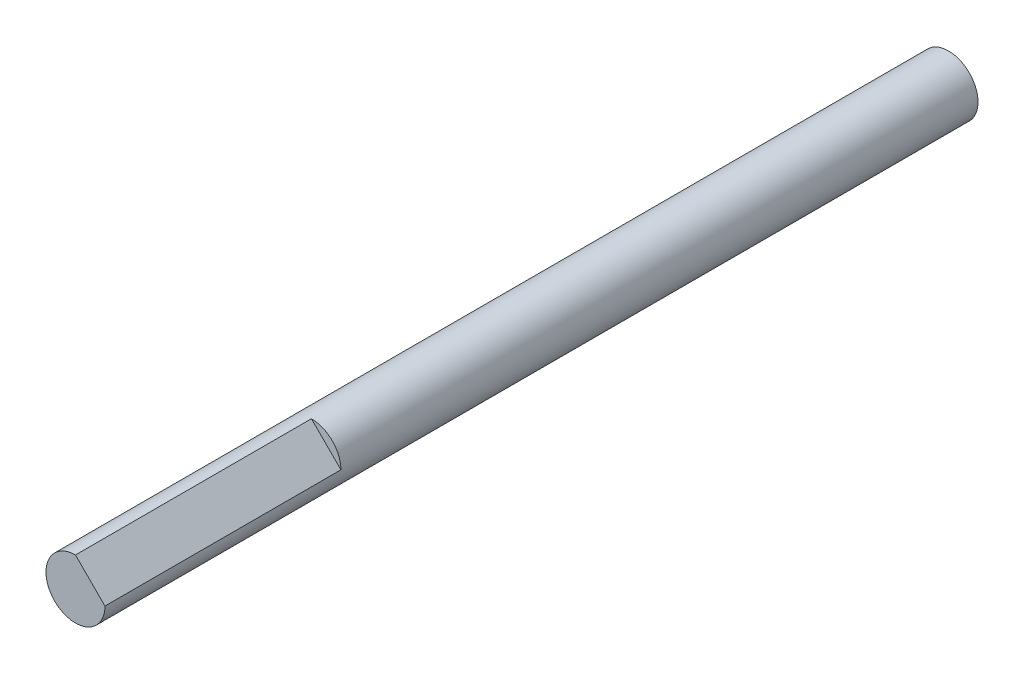
ISO-10303-21;
HEADER;
FILE_DESCRIPTION(('STEP AP214'),'2;1');
FILE_NAME('part.step','',(''),(''),'','','');
FILE_SCHEMA(('AUTOMOTIVE_DESIGN { 1 0 10303 214 1 1 1 1 }'));
ENDSEC;
DATA;
#1=APPLICATION_CONTEXT('core data for automotive mechanical design processes');
#2=APPLICATION_PROTOCOL_DEFINITION('international standard','automotive_design',2000,#1);
#3=PRODUCT_CONTEXT('',#1,'mechanical');
#4=PRODUCT('Part','Part','',(#3));
#5=PRODUCT_RELATED_PRODUCT_CATEGORY('part','',(#4));
#6=PRODUCT_DEFINITION_FORMATION('','',#4);
#7=PRODUCT_DEFINITION_CONTEXT('part definition',#1,'design');
#8=PRODUCT_DEFINITION('design','',#6,#7);
#9=PRODUCT_DEFINITION_SHAPE('','',#8);
#10=(LENGTH_UNIT() NAMED_UNIT(*) SI_UNIT(.MILLI.,.METRE.));
#11=(NAMED_UNIT(*) PLANE_ANGLE_UNIT() SI_UNIT($,.RADIAN.));
#12=(NAMED_UNIT(*) SI_UNIT($,.STERADIAN.) SOLID_ANGLE_UNIT());
#13=UNCERTAINTY_MEASURE_WITH_UNIT(LENGTH_MEASURE(1.E-05),#10,'distance_accuracy_value','');
#14=(GEOMETRIC_REPRESENTATION_CONTEXT(3) GLOBAL_UNCERTAINTY_ASSIGNED_CONTEXT((#13)) GLOBAL_UNIT_ASSIGNED_CONTEXT((#10,
#11,#12)) REPRESENTATION_CONTEXT('',''));
#15=CARTESIAN_POINT('',(0.,0.,0.));
#16=DIRECTION('',(0.,0.,1.));
#17=DIRECTION('',(1.,0.,0.));
#18=AXIS2_PLACEMENT_3D('',#15,#16,#17);
#19=CARTESIAN_POINT('',(0.,0.,0.));
#20=DIRECTION('',(0.,0.,1.));
#21=DIRECTION('',(1.,0.,0.));
#22=AXIS2_PLACEMENT_3D('',#19,#20,#21);
#23=PLANE('',#22);
#24=CARTESIAN_POINT('',(0.,0.,0.));
#25=DIRECTION('',(0.,0.,-1.));
#26=DIRECTION('',(-1.,0.,0.));
#27=AXIS2_PLACEMENT_3D('',#24,#25,#26);
#28=CIRCLE('',#27,2.5);
#29=CARTESIAN_POINT('',(-2.5,0.,0.));
#30=VERTEX_POINT('',#29);
#31=EDGE_CURVE('E40',#30,#30,#28,.T.);
#32=ORIENTED_EDGE('',*,*,#31,.T.);
#33=EDGE_LOOP('',(#32));
#34=FACE_BOUND('',#33,.T.);
#35=ADVANCED_FACE('F33',(#34),#23,.F.);
#36=CARTESIAN_POINT('',(0.,0.,0.));
#37=DIRECTION('',(0.,0.,1.));
#38=DIRECTION('',(1.,0.,0.));
#39=AXIS2_PLACEMENT_3D('',#36,#37,#38);
#40=CYLINDRICAL_SURFACE('',#39,2.5);
#41=DIRECTION('',(0.,0.,1.));
#42=VECTOR('',#41,1.);
#43=CARTESIAN_POINT('',(2.5,0.,54.));
#44=LINE('',#43,#42);
#45=CARTESIAN_POINT('',(2.5,0.,54.));
#46=VERTEX_POINT('',#45);
#47=CARTESIAN_POINT('',(2.5,0.,74.));
#48=VERTEX_POINT('',#47);
#49=EDGE_CURVE('E53',#46,#48,#44,.T.);
#50=ORIENTED_EDGE('',*,*,#49,.T.);
#51=CARTESIAN_POINT('',(0.,0.,74.));
#52=DIRECTION('',(0.,0.,1.));
#53=DIRECTION('',(1.,0.,0.));
#54=AXIS2_PLACEMENT_3D('',#51,#52,#53);
#55=CIRCLE('',#54,2.5);
#56=CARTESIAN_POINT('',(0.,2.5,74.));
#57=VERTEX_POINT('',#56);
#58=EDGE_CURVE('E12',#57,#48,#55,.T.);
#59=ORIENTED_EDGE('',*,*,#58,.F.);
#60=DIRECTION('',(0.,0.,1.));
#61=VECTOR('',#60,1.);
#62=CARTESIAN_POINT('',(0.,2.5,54.));
#63=LINE('',#62,#61);
#64=CARTESIAN_POINT('',(0.,2.5,54.));
#65=VERTEX_POINT('',#64);
#66=EDGE_CURVE('E47',#65,#57,#63,.T.);
#67=ORIENTED_EDGE('',*,*,#66,.F.);
#68=CARTESIAN_POINT('',(0.,0.,54.));
#69=DIRECTION('',(0.,0.,1.));
#70=DIRECTION('',(1.,0.,0.));
#71=AXIS2_PLACEMENT_3D('',#68,#69,#70);
#72=CIRCLE('',#71,2.5);
#73=EDGE_CURVE('E62',#46,#65,#72,.T.);
#74=ORIENTED_EDGE('',*,*,#73,.F.);
#75=EDGE_LOOP('',(#50,#59,#67,#74));
#76=FACE_BOUND('',#75,.T.);
#77=ORIENTED_EDGE('',*,*,#31,.F.);
#78=EDGE_LOOP('',(#77));
#79=FACE_BOUND('',#78,.T.);
#80=ADVANCED_FACE('F66',(#76,#79),#40,.T.);
#81=CARTESIAN_POINT('',(0.,0.,74.));
#82=DIRECTION('',(0.,0.,1.));
#83=DIRECTION('',(1.,0.,0.));
#84=AXIS2_PLACEMENT_3D('',#81,#82,#83);
#85=PLANE('',#84);
#86=DIRECTION('',(0.707106781186548,-0.707106781186548,0.));
#87=VECTOR('',#86,1.);
#88=CARTESIAN_POINT('',(2.5,0.,74.));
#89=LINE('',#88,#87);
#90=EDGE_CURVE('E58',#57,#48,#89,.T.);
#91=ORIENTED_EDGE('',*,*,#90,.F.);
#92=ORIENTED_EDGE('',*,*,#58,.T.);
#93=EDGE_LOOP('',(#91,#92));
#94=FACE_BOUND('',#93,.T.);
#95=ADVANCED_FACE('F69',(#94),#85,.T.);
#96=CARTESIAN_POINT('',(2.5,0.,54.));
#97=DIRECTION('',(-0.707106781186548,-0.707106781186548,0.));
#98=DIRECTION('',(0.707106781186548,-0.707106781186548,0.));
#99=AXIS2_PLACEMENT_3D('',#96,#97,#98);
#100=PLANE('',#99);
#101=ORIENTED_EDGE('',*,*,#90,.T.);
#102=ORIENTED_EDGE('',*,*,#49,.F.);
#103=DIRECTION('',(0.707106781186548,-0.707106781186548,0.));
#104=VECTOR('',#103,1.);
#105=CARTESIAN_POINT('',(2.5,0.,54.));
#106=LINE('',#105,#104);
#107=EDGE_CURVE('E85',#65,#46,#106,.T.);
#108=ORIENTED_EDGE('',*,*,#107,.F.);
#109=ORIENTED_EDGE('',*,*,#66,.T.);
#110=EDGE_LOOP('',(#101,#102,#108,#109));
#111=FACE_BOUND('',#110,.T.);
#112=ADVANCED_FACE('F59',(#111),#100,.F.);
#113=CARTESIAN_POINT('',(0.,0.,54.));
#114=DIRECTION('',(0.,0.,1.));
#115=DIRECTION('',(1.,0.,0.));
#116=AXIS2_PLACEMENT_3D('',#113,#114,#115);
#117=PLANE('',#116);
#118=ORIENTED_EDGE('',*,*,#73,.T.);
#119=ORIENTED_EDGE('',*,*,#107,.T.);
#120=EDGE_LOOP('',(#118,#119));
#121=FACE_BOUND('',#120,.T.);
#122=ADVANCED_FACE('F76',(#121),#117,.T.);
#123=CLOSED_SHELL('',(#35,#80,#95,#112,#122));
#124=MANIFOLD_SOLID_BREP('B2',#123);
#125=ADVANCED_BREP_SHAPE_REPRESENTATION('',(#18,#124),#14);
#126=SHAPE_DEFINITION_REPRESENTATION(#9,#125);
ENDSEC;
END-ISO-10303-21;
